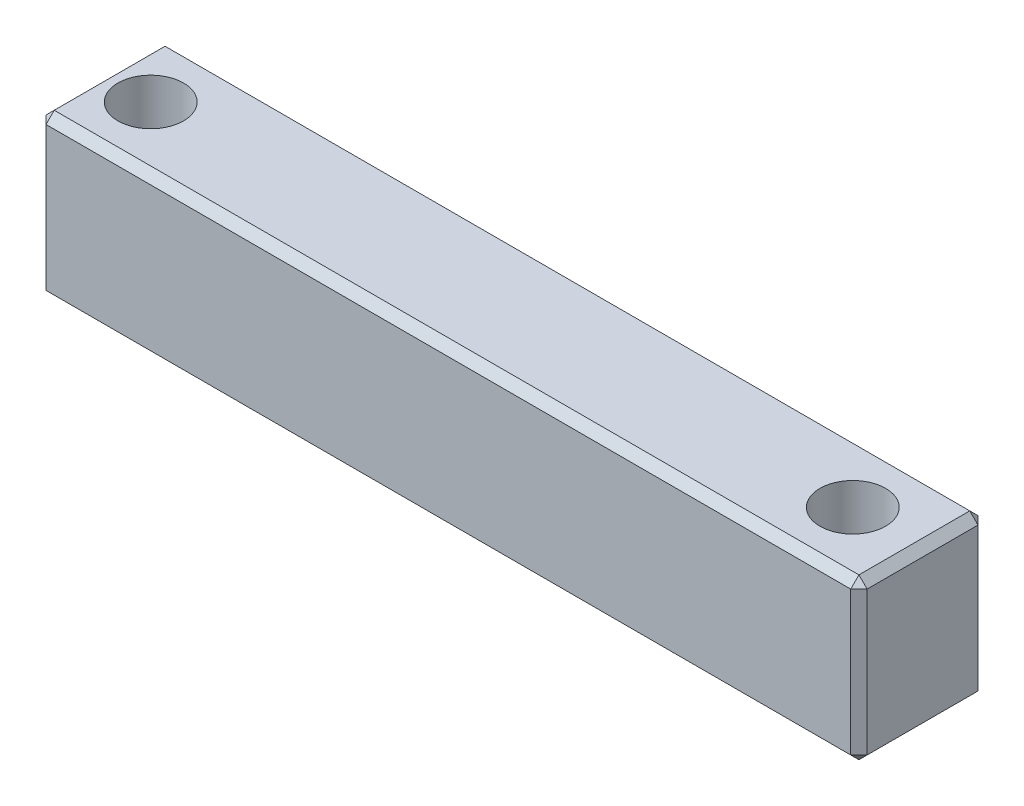
ISO-10303-21;
HEADER;
FILE_DESCRIPTION(('STEP AP214'),'2;1');
FILE_NAME('part.step','',(''),(''),'','','');
FILE_SCHEMA(('AUTOMOTIVE_DESIGN { 1 0 10303 214 1 1 1 1 }'));
ENDSEC;
DATA;
#1=APPLICATION_CONTEXT('core data for automotive mechanical design processes');
#2=APPLICATION_PROTOCOL_DEFINITION('international standard','automotive_design',2000,#1);
#3=PRODUCT_CONTEXT('',#1,'mechanical');
#4=PRODUCT('Part','Part','',(#3));
#5=PRODUCT_RELATED_PRODUCT_CATEGORY('part','',(#4));
#6=PRODUCT_DEFINITION_FORMATION('','',#4);
#7=PRODUCT_DEFINITION_CONTEXT('part definition',#1,'design');
#8=PRODUCT_DEFINITION('design','',#6,#7);
#9=PRODUCT_DEFINITION_SHAPE('','',#8);
#10=(LENGTH_UNIT() NAMED_UNIT(*) SI_UNIT(.MILLI.,.METRE.));
#11=(NAMED_UNIT(*) PLANE_ANGLE_UNIT() SI_UNIT($,.RADIAN.));
#12=(NAMED_UNIT(*) SI_UNIT($,.STERADIAN.) SOLID_ANGLE_UNIT());
#13=UNCERTAINTY_MEASURE_WITH_UNIT(LENGTH_MEASURE(1.E-05),#10,'distance_accuracy_value','');
#14=(GEOMETRIC_REPRESENTATION_CONTEXT(3) GLOBAL_UNCERTAINTY_ASSIGNED_CONTEXT((#13)) GLOBAL_UNIT_ASSIGNED_CONTEXT((#10,
#11,#12)) REPRESENTATION_CONTEXT('',''));
#15=CARTESIAN_POINT('',(0.,0.,0.));
#16=DIRECTION('',(0.,0.,1.));
#17=DIRECTION('',(1.,0.,0.));
#18=AXIS2_PLACEMENT_3D('',#15,#16,#17);
#19=CARTESIAN_POINT('',(50.,0.,0.));
#20=DIRECTION('',(0.,0.,-1.));
#21=DIRECTION('',(0.,1.,0.));
#22=AXIS2_PLACEMENT_3D('',#19,#20,#21);
#23=PLANE('',#22);
#24=DIRECTION('',(1.,0.,0.));
#25=VECTOR('',#24,1.);
#26=CARTESIAN_POINT('',(50.,0.5,0.));
#27=LINE('',#26,#25);
#28=CARTESIAN_POINT('',(0.499999999999994,0.5,0.));
#29=VERTEX_POINT('',#28);
#30=CARTESIAN_POINT('',(49.5,0.5,0.));
#31=VERTEX_POINT('',#30);
#32=EDGE_CURVE('E151',#29,#31,#27,.T.);
#33=ORIENTED_EDGE('',*,*,#32,.T.);
#34=DIRECTION('',(0.,1.,0.));
#35=VECTOR('',#34,1.);
#36=CARTESIAN_POINT('',(49.5,0.,0.));
#37=LINE('',#36,#35);
#38=CARTESIAN_POINT('',(49.5,9.25000000000001,0.));
#39=VERTEX_POINT('',#38);
#40=EDGE_CURVE('E155',#31,#39,#37,.T.);
#41=ORIENTED_EDGE('',*,*,#40,.T.);
#42=DIRECTION('',(-1.,0.,0.));
#43=VECTOR('',#42,1.);
#44=CARTESIAN_POINT('',(50.,9.25000000000001,0.));
#45=LINE('',#44,#43);
#46=CARTESIAN_POINT('',(0.499999999999994,9.25000000000001,0.));
#47=VERTEX_POINT('',#46);
#48=EDGE_CURVE('E128',#39,#47,#45,.T.);
#49=ORIENTED_EDGE('',*,*,#48,.T.);
#50=DIRECTION('',(0.,-1.,0.));
#51=VECTOR('',#50,1.);
#52=CARTESIAN_POINT('',(0.499999999999994,0.,0.));
#53=LINE('',#52,#51);
#54=EDGE_CURVE('E145',#47,#29,#53,.T.);
#55=ORIENTED_EDGE('',*,*,#54,.T.);
#56=EDGE_LOOP('',(#33,#41,#49,#55));
#57=FACE_BOUND('',#56,.T.);
#58=ADVANCED_FACE('F34',(#57),#23,.F.);
#59=CARTESIAN_POINT('',(50.,0.,0.));
#60=DIRECTION('',(0.,1.,0.));
#61=DIRECTION('',(0.,0.,1.));
#62=AXIS2_PLACEMENT_3D('',#59,#60,#61);
#63=PLANE('',#62);
#64=DIRECTION('',(0.,0.,1.));
#65=VECTOR('',#64,1.);
#66=CARTESIAN_POINT('',(49.5,0.,0.));
#67=LINE('',#66,#65);
#68=CARTESIAN_POINT('',(49.5,0.,-7.25));
#69=VERTEX_POINT('',#68);
#70=CARTESIAN_POINT('',(49.5,0.,-0.499999999999993));
#71=VERTEX_POINT('',#70);
#72=EDGE_CURVE('E172',#69,#71,#67,.T.);
#73=ORIENTED_EDGE('',*,*,#72,.T.);
#74=DIRECTION('',(-1.,0.,0.));
#75=VECTOR('',#74,1.);
#76=CARTESIAN_POINT('',(50.,0.,-0.499999999999993));
#77=LINE('',#76,#75);
#78=CARTESIAN_POINT('',(0.499999999999994,0.,-0.499999999999993));
#79=VERTEX_POINT('',#78);
#80=EDGE_CURVE('E174',#71,#79,#77,.T.);
#81=ORIENTED_EDGE('',*,*,#80,.T.);
#82=DIRECTION('',(0.,0.,-1.));
#83=VECTOR('',#82,1.);
#84=CARTESIAN_POINT('',(0.499999999999994,0.,-7.75000000000001));
#85=LINE('',#84,#83);
#86=CARTESIAN_POINT('',(0.499999999999994,0.,-7.25));
#87=VERTEX_POINT('',#86);
#88=EDGE_CURVE('E170',#79,#87,#85,.T.);
#89=ORIENTED_EDGE('',*,*,#88,.T.);
#90=DIRECTION('',(1.,0.,0.));
#91=VECTOR('',#90,1.);
#92=CARTESIAN_POINT('',(50.,0.,-7.25));
#93=LINE('',#92,#91);
#94=EDGE_CURVE('E168',#87,#69,#93,.T.);
#95=ORIENTED_EDGE('',*,*,#94,.T.);
#96=EDGE_LOOP('',(#73,#81,#89,#95));
#97=FACE_BOUND('',#96,.T.);
#98=CARTESIAN_POINT('',(3.,0.,-3.875));
#99=DIRECTION('',(0.,1.,0.));
#100=DIRECTION('',(0.,0.,1.));
#101=AXIS2_PLACEMENT_3D('',#98,#99,#100);
#102=CIRCLE('',#101,2.);
#103=CARTESIAN_POINT('',(3.,0.,-1.875));
#104=VERTEX_POINT('',#103);
#105=EDGE_CURVE('E152',#104,#104,#102,.F.);
#106=ORIENTED_EDGE('',*,*,#105,.F.);
#107=EDGE_LOOP('',(#106));
#108=FACE_BOUND('',#107,.T.);
#109=CARTESIAN_POINT('',(45.75,0.,-3.87499999999999));
#110=DIRECTION('',(0.,1.,0.));
#111=DIRECTION('',(0.,0.,1.));
#112=AXIS2_PLACEMENT_3D('',#109,#110,#111);
#113=CIRCLE('',#112,2.);
#114=CARTESIAN_POINT('',(45.75,0.,-1.875));
#115=VERTEX_POINT('',#114);
#116=EDGE_CURVE('E262',#115,#115,#113,.F.);
#117=ORIENTED_EDGE('',*,*,#116,.F.);
#118=EDGE_LOOP('',(#117));
#119=FACE_BOUND('',#118,.T.);
#120=ADVANCED_FACE('F291',(#97,#108,#119),#63,.F.);
#121=CARTESIAN_POINT('',(50.,0.,-7.75000000000001));
#122=DIRECTION('',(0.,0.,1.));
#123=DIRECTION('',(0.,-1.,0.));
#124=AXIS2_PLACEMENT_3D('',#121,#122,#123);
#125=PLANE('',#124);
#126=DIRECTION('',(0.,-1.,0.));
#127=VECTOR('',#126,1.);
#128=CARTESIAN_POINT('',(49.5,0.,-7.75000000000001));
#129=LINE('',#128,#127);
#130=CARTESIAN_POINT('',(49.5,9.25000000000001,-7.75));
#131=VERTEX_POINT('',#130);
#132=CARTESIAN_POINT('',(49.5,0.499999999999994,-7.75000000000001));
#133=VERTEX_POINT('',#132);
#134=EDGE_CURVE('E44',#131,#133,#129,.T.);
#135=ORIENTED_EDGE('',*,*,#134,.T.);
#136=DIRECTION('',(-1.,0.,0.));
#137=VECTOR('',#136,1.);
#138=CARTESIAN_POINT('',(50.,0.499999999999994,-7.75000000000001));
#139=LINE('',#138,#137);
#140=CARTESIAN_POINT('',(0.499999999999994,0.499999999999994,-7.75000000000001));
#141=VERTEX_POINT('',#140);
#142=EDGE_CURVE('E11',#133,#141,#139,.T.);
#143=ORIENTED_EDGE('',*,*,#142,.T.);
#144=DIRECTION('',(0.,1.,0.));
#145=VECTOR('',#144,1.);
#146=CARTESIAN_POINT('',(0.499999999999994,9.75,-7.75));
#147=LINE('',#146,#145);
#148=CARTESIAN_POINT('',(0.499999999999994,9.25000000000001,-7.75));
#149=VERTEX_POINT('',#148);
#150=EDGE_CURVE('E195',#141,#149,#147,.T.);
#151=ORIENTED_EDGE('',*,*,#150,.T.);
#152=DIRECTION('',(1.,0.,0.));
#153=VECTOR('',#152,1.);
#154=CARTESIAN_POINT('',(50.,9.25000000000001,-7.75));
#155=LINE('',#154,#153);
#156=EDGE_CURVE('E55',#149,#131,#155,.T.);
#157=ORIENTED_EDGE('',*,*,#156,.T.);
#158=EDGE_LOOP('',(#135,#143,#151,#157));
#159=FACE_BOUND('',#158,.T.);
#160=ADVANCED_FACE('F281',(#159),#125,.F.);
#161=CARTESIAN_POINT('',(50.,9.75,0.));
#162=DIRECTION('',(0.,-1.,0.));
#163=DIRECTION('',(0.,0.,-1.));
#164=AXIS2_PLACEMENT_3D('',#161,#162,#163);
#165=PLANE('',#164);
#166=DIRECTION('',(0.,0.,1.));
#167=VECTOR('',#166,1.);
#168=CARTESIAN_POINT('',(0.499999999999994,9.75,0.));
#169=LINE('',#168,#167);
#170=CARTESIAN_POINT('',(0.499999999999994,9.75,-7.25));
#171=VERTEX_POINT('',#170);
#172=CARTESIAN_POINT('',(0.499999999999994,9.75,-0.499999999999994));
#173=VERTEX_POINT('',#172);
#174=EDGE_CURVE('E163',#171,#173,#169,.T.);
#175=ORIENTED_EDGE('',*,*,#174,.T.);
#176=DIRECTION('',(1.,0.,0.));
#177=VECTOR('',#176,1.);
#178=CARTESIAN_POINT('',(50.,9.75,-0.499999999999994));
#179=LINE('',#178,#177);
#180=CARTESIAN_POINT('',(49.5,9.75,-0.499999999999994));
#181=VERTEX_POINT('',#180);
#182=EDGE_CURVE('E130',#173,#181,#179,.T.);
#183=ORIENTED_EDGE('',*,*,#182,.T.);
#184=DIRECTION('',(0.,0.,-1.));
#185=VECTOR('',#184,1.);
#186=CARTESIAN_POINT('',(49.5,9.75,0.));
#187=LINE('',#186,#185);
#188=CARTESIAN_POINT('',(49.5,9.75,-7.25));
#189=VERTEX_POINT('',#188);
#190=EDGE_CURVE('E165',#181,#189,#187,.T.);
#191=ORIENTED_EDGE('',*,*,#190,.T.);
#192=DIRECTION('',(-1.,0.,0.));
#193=VECTOR('',#192,1.);
#194=CARTESIAN_POINT('',(50.,9.75,-7.25));
#195=LINE('',#194,#193);
#196=EDGE_CURVE('E158',#189,#171,#195,.T.);
#197=ORIENTED_EDGE('',*,*,#196,.T.);
#198=EDGE_LOOP('',(#175,#183,#191,#197));
#199=FACE_BOUND('',#198,.T.);
#200=CARTESIAN_POINT('',(3.,9.75,-3.875));
#201=DIRECTION('',(0.,1.,0.));
#202=DIRECTION('',(0.,0.,1.));
#203=AXIS2_PLACEMENT_3D('',#200,#201,#202);
#204=CIRCLE('',#203,2.);
#205=CARTESIAN_POINT('',(3.,9.75,-1.875));
#206=VERTEX_POINT('',#205);
#207=EDGE_CURVE('E267',#206,#206,#204,.T.);
#208=ORIENTED_EDGE('',*,*,#207,.F.);
#209=EDGE_LOOP('',(#208));
#210=FACE_BOUND('',#209,.T.);
#211=CARTESIAN_POINT('',(45.75,9.75,-3.87499999999999));
#212=DIRECTION('',(0.,1.,0.));
#213=DIRECTION('',(0.,0.,1.));
#214=AXIS2_PLACEMENT_3D('',#211,#212,#213);
#215=CIRCLE('',#214,2.);
#216=CARTESIAN_POINT('',(45.75,9.75,-1.875));
#217=VERTEX_POINT('',#216);
#218=EDGE_CURVE('E256',#217,#217,#215,.T.);
#219=ORIENTED_EDGE('',*,*,#218,.F.);
#220=EDGE_LOOP('',(#219));
#221=FACE_BOUND('',#220,.T.);
#222=ADVANCED_FACE('F277',(#199,#210,#221),#165,.F.);
#223=CARTESIAN_POINT('',(50.,0.,0.));
#224=DIRECTION('',(-1.,0.,0.));
#225=DIRECTION('',(0.,0.,1.));
#226=AXIS2_PLACEMENT_3D('',#223,#224,#225);
#227=PLANE('',#226);
#228=DIRECTION('',(0.,1.,0.));
#229=VECTOR('',#228,1.);
#230=CARTESIAN_POINT('',(50.,0.,-7.25));
#231=LINE('',#230,#229);
#232=CARTESIAN_POINT('',(50.,0.499999999999994,-7.25));
#233=VERTEX_POINT('',#232);
#234=CARTESIAN_POINT('',(50.,9.25000000000001,-7.25));
#235=VERTEX_POINT('',#234);
#236=EDGE_CURVE('E177',#233,#235,#231,.T.);
#237=ORIENTED_EDGE('',*,*,#236,.T.);
#238=DIRECTION('',(0.,0.,1.));
#239=VECTOR('',#238,1.);
#240=CARTESIAN_POINT('',(50.,9.25000000000001,0.));
#241=LINE('',#240,#239);
#242=CARTESIAN_POINT('',(50.,9.25000000000001,-0.499999999999987));
#243=VERTEX_POINT('',#242);
#244=EDGE_CURVE('E183',#235,#243,#241,.T.);
#245=ORIENTED_EDGE('',*,*,#244,.T.);
#246=DIRECTION('',(0.,-1.,0.));
#247=VECTOR('',#246,1.);
#248=CARTESIAN_POINT('',(50.,0.,-0.499999999999994));
#249=LINE('',#248,#247);
#250=CARTESIAN_POINT('',(50.,0.499999999999994,-0.499999999999993));
#251=VERTEX_POINT('',#250);
#252=EDGE_CURVE('E181',#243,#251,#249,.T.);
#253=ORIENTED_EDGE('',*,*,#252,.T.);
#254=DIRECTION('',(0.,0.,-1.));
#255=VECTOR('',#254,1.);
#256=CARTESIAN_POINT('',(50.,0.499999999999994,0.));
#257=LINE('',#256,#255);
#258=EDGE_CURVE('E179',#251,#233,#257,.T.);
#259=ORIENTED_EDGE('',*,*,#258,.T.);
#260=EDGE_LOOP('',(#237,#245,#253,#259));
#261=FACE_BOUND('',#260,.T.);
#262=ADVANCED_FACE('F280',(#261),#227,.F.);
#263=CARTESIAN_POINT('',(0.,0.,0.));
#264=DIRECTION('',(-1.,0.,0.));
#265=DIRECTION('',(0.,0.,1.));
#266=AXIS2_PLACEMENT_3D('',#263,#264,#265);
#267=PLANE('',#266);
#268=DIRECTION('',(0.,-1.,0.));
#269=VECTOR('',#268,1.);
#270=CARTESIAN_POINT('',(0.,0.,-7.25));
#271=LINE('',#270,#269);
#272=CARTESIAN_POINT('',(0.,9.25,-7.25));
#273=VERTEX_POINT('',#272);
#274=CARTESIAN_POINT('',(0.,0.5,-7.25));
#275=VERTEX_POINT('',#274);
#276=EDGE_CURVE('E186',#273,#275,#271,.T.);
#277=ORIENTED_EDGE('',*,*,#276,.T.);
#278=DIRECTION('',(0.,0.,1.));
#279=VECTOR('',#278,1.);
#280=CARTESIAN_POINT('',(0.,0.5,0.));
#281=LINE('',#280,#279);
#282=CARTESIAN_POINT('',(0.,0.5,-0.5));
#283=VERTEX_POINT('',#282);
#284=EDGE_CURVE('E192',#275,#283,#281,.T.);
#285=ORIENTED_EDGE('',*,*,#284,.T.);
#286=DIRECTION('',(0.,1.,0.));
#287=VECTOR('',#286,1.);
#288=CARTESIAN_POINT('',(0.,9.75,-0.499999999999993));
#289=LINE('',#288,#287);
#290=CARTESIAN_POINT('',(0.,9.25,-0.499999999999994));
#291=VERTEX_POINT('',#290);
#292=EDGE_CURVE('E190',#283,#291,#289,.T.);
#293=ORIENTED_EDGE('',*,*,#292,.T.);
#294=DIRECTION('',(0.,0.,-1.));
#295=VECTOR('',#294,1.);
#296=CARTESIAN_POINT('',(0.,9.25,-7.75));
#297=LINE('',#296,#295);
#298=EDGE_CURVE('E188',#291,#273,#297,.T.);
#299=ORIENTED_EDGE('',*,*,#298,.T.);
#300=EDGE_LOOP('',(#277,#285,#293,#299));
#301=FACE_BOUND('',#300,.T.);
#302=ADVANCED_FACE('F288',(#301),#267,.T.);
#303=CARTESIAN_POINT('',(45.75,-5.65685424949238,-3.87499999999999));
#304=DIRECTION('',(0.,1.,0.));
#305=DIRECTION('',(0.,0.,1.));
#306=AXIS2_PLACEMENT_3D('',#303,#304,#305);
#307=CYLINDRICAL_SURFACE('',#306,2.);
#308=ORIENTED_EDGE('',*,*,#116,.T.);
#309=EDGE_LOOP('',(#308));
#310=FACE_BOUND('',#309,.T.);
#311=ORIENTED_EDGE('',*,*,#218,.T.);
#312=EDGE_LOOP('',(#311));
#313=FACE_BOUND('',#312,.T.);
#314=ADVANCED_FACE('F459',(#310,#313),#307,.F.);
#315=CARTESIAN_POINT('',(3.,-5.65685424949238,-3.875));
#316=DIRECTION('',(0.,1.,0.));
#317=DIRECTION('',(0.,0.,1.));
#318=AXIS2_PLACEMENT_3D('',#315,#316,#317);
#319=CYLINDRICAL_SURFACE('',#318,2.);
#320=ORIENTED_EDGE('',*,*,#105,.T.);
#321=EDGE_LOOP('',(#320));
#322=FACE_BOUND('',#321,.T.);
#323=ORIENTED_EDGE('',*,*,#207,.T.);
#324=EDGE_LOOP('',(#323));
#325=FACE_BOUND('',#324,.T.);
#326=ADVANCED_FACE('F275',(#322,#325),#319,.F.);
#327=CARTESIAN_POINT('',(50.,0.499999999999994,-7.75000000000001));
#328=DIRECTION('',(0.,0.707106781186552,0.707106781186543));
#329=DIRECTION('',(-1.,0.,0.));
#330=AXIS2_PLACEMENT_3D('',#327,#328,#329);
#331=PLANE('',#330);
#332=DIRECTION('',(0.,-0.707106781186543,0.707106781186552));
#333=VECTOR('',#332,1.);
#334=CARTESIAN_POINT('',(49.5,0.249999999999997,-7.50000000000001));
#335=LINE('',#334,#333);
#336=EDGE_CURVE('E39',#69,#133,#335,.F.);
#337=ORIENTED_EDGE('',*,*,#336,.F.);
#338=ORIENTED_EDGE('',*,*,#94,.F.);
#339=DIRECTION('',(0.,0.707106781186543,-0.707106781186552));
#340=VECTOR('',#339,1.);
#341=CARTESIAN_POINT('',(0.499999999999994,0.,-7.25));
#342=LINE('',#341,#340);
#343=EDGE_CURVE('E249',#141,#87,#342,.F.);
#344=ORIENTED_EDGE('',*,*,#343,.F.);
#345=ORIENTED_EDGE('',*,*,#142,.F.);
#346=EDGE_LOOP('',(#337,#338,#344,#345));
#347=FACE_BOUND('',#346,.T.);
#348=ADVANCED_FACE('F37',(#347),#331,.F.);
#349=CARTESIAN_POINT('',(50.,0.499999999999994,-7.25));
#350=DIRECTION('',(0.577350269189626,-0.577350269189634,-0.577350269189618));
#351=DIRECTION('',(0.707106781186552,0.707106781186543,0.));
#352=AXIS2_PLACEMENT_3D('',#349,#350,#351);
#353=PLANE('',#352);
#354=DIRECTION('',(0.707106781186552,0.707106781186543,0.));
#355=VECTOR('',#354,1.);
#356=CARTESIAN_POINT('',(50.,0.499999999999994,-7.25));
#357=LINE('',#356,#355);
#358=EDGE_CURVE('E244',#69,#233,#357,.T.);
#359=ORIENTED_EDGE('',*,*,#358,.F.);
#360=ORIENTED_EDGE('',*,*,#336,.T.);
#361=DIRECTION('',(-0.707106781186543,0.,-0.707106781186552));
#362=VECTOR('',#361,1.);
#363=CARTESIAN_POINT('',(50.,0.499999999999994,-7.25));
#364=LINE('',#363,#362);
#365=EDGE_CURVE('E247',#233,#133,#364,.T.);
#366=ORIENTED_EDGE('',*,*,#365,.F.);
#367=EDGE_LOOP('',(#359,#360,#366));
#368=FACE_BOUND('',#367,.T.);
#369=ADVANCED_FACE('F421',(#368),#353,.T.);
#370=CARTESIAN_POINT('',(0.499999999999994,0.,-7.25));
#371=DIRECTION('',(-0.577350269189634,-0.577350269189626,-0.577350269189618));
#372=DIRECTION('',(0.707106781186543,-0.707106781186552,0.));
#373=AXIS2_PLACEMENT_3D('',#370,#371,#372);
#374=PLANE('',#373);
#375=DIRECTION('',(0.707106781186543,0.,-0.707106781186552));
#376=VECTOR('',#375,1.);
#377=CARTESIAN_POINT('',(0.249999999999997,0.499999999999997,-7.50000000000001));
#378=LINE('',#377,#376);
#379=EDGE_CURVE('E238',#141,#275,#378,.F.);
#380=ORIENTED_EDGE('',*,*,#379,.F.);
#381=ORIENTED_EDGE('',*,*,#343,.T.);
#382=DIRECTION('',(-0.707106781186543,0.707106781186552,0.));
#383=VECTOR('',#382,1.);
#384=CARTESIAN_POINT('',(0.499999999999994,0.,-7.25));
#385=LINE('',#384,#383);
#386=EDGE_CURVE('E241',#275,#87,#385,.F.);
#387=ORIENTED_EDGE('',*,*,#386,.F.);
#388=EDGE_LOOP('',(#380,#381,#387));
#389=FACE_BOUND('',#388,.T.);
#390=ADVANCED_FACE('F415',(#389),#374,.T.);
#391=CARTESIAN_POINT('',(50.,0.,-7.25));
#392=DIRECTION('',(-0.707106781186552,0.,0.707106781186543));
#393=DIRECTION('',(0.,1.,0.));
#394=AXIS2_PLACEMENT_3D('',#391,#392,#393);
#395=PLANE('',#394);
#396=ORIENTED_EDGE('',*,*,#365,.T.);
#397=ORIENTED_EDGE('',*,*,#134,.F.);
#398=DIRECTION('',(0.707106781186543,0.,0.707106781186552));
#399=VECTOR('',#398,1.);
#400=CARTESIAN_POINT('',(49.75,9.25000000000001,-7.5));
#401=LINE('',#400,#399);
#402=EDGE_CURVE('E232',#235,#131,#401,.F.);
#403=ORIENTED_EDGE('',*,*,#402,.F.);
#404=ORIENTED_EDGE('',*,*,#236,.F.);
#405=EDGE_LOOP('',(#396,#397,#403,#404));
#406=FACE_BOUND('',#405,.T.);
#407=ADVANCED_FACE('F408',(#406),#395,.F.);
#408=CARTESIAN_POINT('',(50.,0.499999999999994,0.));
#409=DIRECTION('',(-0.707106781186543,0.707106781186552,0.));
#410=DIRECTION('',(0.,0.,-1.));
#411=AXIS2_PLACEMENT_3D('',#408,#409,#410);
#412=PLANE('',#411);
#413=ORIENTED_EDGE('',*,*,#358,.T.);
#414=ORIENTED_EDGE('',*,*,#258,.F.);
#415=DIRECTION('',(-0.707106781186552,-0.707106781186543,0.));
#416=VECTOR('',#415,1.);
#417=CARTESIAN_POINT('',(49.75,0.249999999999997,-0.499999999999993));
#418=LINE('',#417,#416);
#419=EDGE_CURVE('E229',#71,#251,#418,.F.);
#420=ORIENTED_EDGE('',*,*,#419,.F.);
#421=ORIENTED_EDGE('',*,*,#72,.F.);
#422=EDGE_LOOP('',(#413,#414,#420,#421));
#423=FACE_BOUND('',#422,.T.);
#424=ADVANCED_FACE('F401',(#423),#412,.F.);
#425=CARTESIAN_POINT('',(50.,0.,-0.499999999999993));
#426=DIRECTION('',(0.,0.707106781186543,-0.707106781186552));
#427=DIRECTION('',(-1.,0.,0.));
#428=AXIS2_PLACEMENT_3D('',#425,#426,#427);
#429=PLANE('',#428);
#430=DIRECTION('',(0.,-0.707106781186552,-0.707106781186543));
#431=VECTOR('',#430,1.);
#432=CARTESIAN_POINT('',(0.499999999999994,0.,-0.499999999999993));
#433=LINE('',#432,#431);
#434=EDGE_CURVE('E223',#79,#29,#433,.F.);
#435=ORIENTED_EDGE('',*,*,#434,.F.);
#436=ORIENTED_EDGE('',*,*,#80,.F.);
#437=DIRECTION('',(0.,0.707106781186552,0.707106781186543));
#438=VECTOR('',#437,1.);
#439=CARTESIAN_POINT('',(49.5,0.5,0.));
#440=LINE('',#439,#438);
#441=EDGE_CURVE('E226',#31,#71,#440,.F.);
#442=ORIENTED_EDGE('',*,*,#441,.F.);
#443=ORIENTED_EDGE('',*,*,#32,.F.);
#444=EDGE_LOOP('',(#435,#436,#442,#443));
#445=FACE_BOUND('',#444,.T.);
#446=ADVANCED_FACE('F394',(#445),#429,.F.);
#447=CARTESIAN_POINT('',(0.499999999999994,0.,0.));
#448=DIRECTION('',(-0.707106781186552,-0.707106781186543,0.));
#449=DIRECTION('',(0.,0.,1.));
#450=AXIS2_PLACEMENT_3D('',#447,#448,#449);
#451=PLANE('',#450);
#452=ORIENTED_EDGE('',*,*,#386,.T.);
#453=ORIENTED_EDGE('',*,*,#88,.F.);
#454=DIRECTION('',(0.707106781186543,-0.707106781186552,0.));
#455=VECTOR('',#454,1.);
#456=CARTESIAN_POINT('',(0.499999999999994,0.,-0.499999999999993));
#457=LINE('',#456,#455);
#458=EDGE_CURVE('E221',#283,#79,#457,.T.);
#459=ORIENTED_EDGE('',*,*,#458,.F.);
#460=ORIENTED_EDGE('',*,*,#284,.F.);
#461=EDGE_LOOP('',(#452,#453,#459,#460));
#462=FACE_BOUND('',#461,.T.);
#463=ADVANCED_FACE('F387',(#462),#451,.T.);
#464=CARTESIAN_POINT('',(0.499999999999994,0.,-7.75000000000001));
#465=DIRECTION('',(-0.707106781186552,0.,-0.707106781186543));
#466=DIRECTION('',(0.,-1.,0.));
#467=AXIS2_PLACEMENT_3D('',#464,#465,#466);
#468=PLANE('',#467);
#469=ORIENTED_EDGE('',*,*,#379,.T.);
#470=ORIENTED_EDGE('',*,*,#276,.F.);
#471=DIRECTION('',(-0.707106781186543,0.,0.707106781186552));
#472=VECTOR('',#471,1.);
#473=CARTESIAN_POINT('',(0.,9.25,-7.25));
#474=LINE('',#473,#472);
#475=EDGE_CURVE('E218',#149,#273,#474,.T.);
#476=ORIENTED_EDGE('',*,*,#475,.F.);
#477=ORIENTED_EDGE('',*,*,#150,.F.);
#478=EDGE_LOOP('',(#469,#470,#476,#477));
#479=FACE_BOUND('',#478,.T.);
#480=ADVANCED_FACE('F380',(#479),#468,.T.);
#481=CARTESIAN_POINT('',(50.,9.75,-7.25));
#482=DIRECTION('',(0.,-0.707106781186552,0.707106781186543));
#483=DIRECTION('',(-1.,0.,0.));
#484=AXIS2_PLACEMENT_3D('',#481,#482,#483);
#485=PLANE('',#484);
#486=DIRECTION('',(0.,-0.707106781186543,-0.707106781186552));
#487=VECTOR('',#486,1.);
#488=CARTESIAN_POINT('',(49.5,9.75,-7.25));
#489=LINE('',#488,#487);
#490=EDGE_CURVE('E235',#131,#189,#489,.F.);
#491=ORIENTED_EDGE('',*,*,#490,.F.);
#492=ORIENTED_EDGE('',*,*,#156,.F.);
#493=DIRECTION('',(0.,0.707106781186543,0.707106781186552));
#494=VECTOR('',#493,1.);
#495=CARTESIAN_POINT('',(0.499999999999993,9.5,-7.5));
#496=LINE('',#495,#494);
#497=EDGE_CURVE('E215',#171,#149,#496,.F.);
#498=ORIENTED_EDGE('',*,*,#497,.F.);
#499=ORIENTED_EDGE('',*,*,#196,.F.);
#500=EDGE_LOOP('',(#491,#492,#498,#499));
#501=FACE_BOUND('',#500,.T.);
#502=ADVANCED_FACE('F373',(#501),#485,.F.);
#503=CARTESIAN_POINT('',(49.5,9.75,-7.25));
#504=DIRECTION('',(0.577350269189626,0.577350269189634,-0.577350269189618));
#505=DIRECTION('',(-0.707106781186552,0.707106781186543,0.));
#506=AXIS2_PLACEMENT_3D('',#503,#504,#505);
#507=PLANE('',#506);
#508=ORIENTED_EDGE('',*,*,#402,.T.);
#509=ORIENTED_EDGE('',*,*,#490,.T.);
#510=DIRECTION('',(-0.707106781186552,0.707106781186543,0.));
#511=VECTOR('',#510,1.);
#512=CARTESIAN_POINT('',(49.5,9.75,-7.25));
#513=LINE('',#512,#511);
#514=EDGE_CURVE('E212',#235,#189,#513,.T.);
#515=ORIENTED_EDGE('',*,*,#514,.F.);
#516=EDGE_LOOP('',(#508,#509,#515));
#517=FACE_BOUND('',#516,.T.);
#518=ADVANCED_FACE('F366',(#517),#507,.T.);
#519=CARTESIAN_POINT('',(49.5,0.5,0.));
#520=DIRECTION('',(0.577350269189618,-0.577350269189626,0.577350269189634));
#521=DIRECTION('',(0.,-0.707106781186552,-0.707106781186543));
#522=AXIS2_PLACEMENT_3D('',#519,#520,#521);
#523=PLANE('',#522);
#524=ORIENTED_EDGE('',*,*,#441,.T.);
#525=ORIENTED_EDGE('',*,*,#419,.T.);
#526=DIRECTION('',(0.707106781186552,0.,-0.707106781186543));
#527=VECTOR('',#526,1.);
#528=CARTESIAN_POINT('',(49.5,0.5,0.));
#529=LINE('',#528,#527);
#530=EDGE_CURVE('E209',#31,#251,#529,.T.);
#531=ORIENTED_EDGE('',*,*,#530,.F.);
#532=EDGE_LOOP('',(#524,#525,#531));
#533=FACE_BOUND('',#532,.T.);
#534=ADVANCED_FACE('F359',(#533),#523,.T.);
#535=CARTESIAN_POINT('',(0.499999999999994,0.,-0.499999999999993));
#536=DIRECTION('',(-0.577350269189634,-0.577350269189618,0.577350269189626));
#537=DIRECTION('',(0.707106781186543,0.,0.707106781186553));
#538=AXIS2_PLACEMENT_3D('',#535,#536,#537);
#539=PLANE('',#538);
#540=ORIENTED_EDGE('',*,*,#458,.T.);
#541=ORIENTED_EDGE('',*,*,#434,.T.);
#542=DIRECTION('',(-0.707106781186543,0.,-0.707106781186552));
#543=VECTOR('',#542,1.);
#544=CARTESIAN_POINT('',(0.249999999999997,0.5,-0.25));
#545=LINE('',#544,#543);
#546=EDGE_CURVE('E148',#283,#29,#545,.F.);
#547=ORIENTED_EDGE('',*,*,#546,.F.);
#548=EDGE_LOOP('',(#540,#541,#547));
#549=FACE_BOUND('',#548,.T.);
#550=ADVANCED_FACE('F352',(#549),#539,.T.);
#551=CARTESIAN_POINT('',(0.,9.25,-7.25));
#552=DIRECTION('',(-0.577350269189634,0.577350269189626,-0.577350269189618));
#553=DIRECTION('',(-0.707106781186543,-0.707106781186552,0.));
#554=AXIS2_PLACEMENT_3D('',#551,#552,#553);
#555=PLANE('',#554);
#556=ORIENTED_EDGE('',*,*,#497,.T.);
#557=ORIENTED_EDGE('',*,*,#475,.T.);
#558=DIRECTION('',(0.707106781186543,0.707106781186552,0.));
#559=VECTOR('',#558,1.);
#560=CARTESIAN_POINT('',(0.,9.25,-7.25));
#561=LINE('',#560,#559);
#562=EDGE_CURVE('E205',#171,#273,#561,.F.);
#563=ORIENTED_EDGE('',*,*,#562,.F.);
#564=EDGE_LOOP('',(#556,#557,#563));
#565=FACE_BOUND('',#564,.T.);
#566=ADVANCED_FACE('F345',(#565),#555,.T.);
#567=CARTESIAN_POINT('',(50.,9.25000000000001,0.));
#568=DIRECTION('',(-0.707106781186543,-0.707106781186552,0.));
#569=DIRECTION('',(0.,0.,1.));
#570=AXIS2_PLACEMENT_3D('',#567,#568,#569);
#571=PLANE('',#570);
#572=ORIENTED_EDGE('',*,*,#514,.T.);
#573=ORIENTED_EDGE('',*,*,#190,.F.);
#574=DIRECTION('',(0.707106781186552,-0.707106781186543,0.));
#575=VECTOR('',#574,1.);
#576=CARTESIAN_POINT('',(49.5,9.75,-0.499999999999994));
#577=LINE('',#576,#575);
#578=EDGE_CURVE('E202',#243,#181,#577,.F.);
#579=ORIENTED_EDGE('',*,*,#578,.F.);
#580=ORIENTED_EDGE('',*,*,#244,.F.);
#581=EDGE_LOOP('',(#572,#573,#579,#580));
#582=FACE_BOUND('',#581,.T.);
#583=ADVANCED_FACE('F338',(#582),#571,.F.);
#584=CARTESIAN_POINT('',(50.,0.,-0.499999999999994));
#585=DIRECTION('',(-0.707106781186543,0.,-0.707106781186552));
#586=DIRECTION('',(0.,-1.,0.));
#587=AXIS2_PLACEMENT_3D('',#584,#585,#586);
#588=PLANE('',#587);
#589=ORIENTED_EDGE('',*,*,#530,.T.);
#590=ORIENTED_EDGE('',*,*,#252,.F.);
#591=DIRECTION('',(-0.707106781186552,0.,0.707106781186543));
#592=VECTOR('',#591,1.);
#593=CARTESIAN_POINT('',(49.75,9.25000000000001,-0.24999999999999));
#594=LINE('',#593,#592);
#595=EDGE_CURVE('E142',#39,#243,#594,.F.);
#596=ORIENTED_EDGE('',*,*,#595,.F.);
#597=ORIENTED_EDGE('',*,*,#40,.F.);
#598=EDGE_LOOP('',(#589,#590,#596,#597));
#599=FACE_BOUND('',#598,.T.);
#600=ADVANCED_FACE('F332',(#599),#588,.F.);
#601=CARTESIAN_POINT('',(0.499999999999994,0.,0.));
#602=DIRECTION('',(-0.707106781186552,0.,0.707106781186543));
#603=DIRECTION('',(0.,1.,0.));
#604=AXIS2_PLACEMENT_3D('',#601,#602,#603);
#605=PLANE('',#604);
#606=ORIENTED_EDGE('',*,*,#546,.T.);
#607=ORIENTED_EDGE('',*,*,#54,.F.);
#608=DIRECTION('',(0.707106781186543,0.,0.707106781186552));
#609=VECTOR('',#608,1.);
#610=CARTESIAN_POINT('',(0.499999999999994,9.25000000000001,0.));
#611=LINE('',#610,#609);
#612=EDGE_CURVE('E136',#291,#47,#611,.T.);
#613=ORIENTED_EDGE('',*,*,#612,.F.);
#614=ORIENTED_EDGE('',*,*,#292,.F.);
#615=EDGE_LOOP('',(#606,#607,#613,#614));
#616=FACE_BOUND('',#615,.T.);
#617=ADVANCED_FACE('F146',(#616),#605,.T.);
#618=CARTESIAN_POINT('',(0.499999999999994,9.75,0.));
#619=DIRECTION('',(-0.707106781186552,0.707106781186543,0.));
#620=DIRECTION('',(0.,0.,-1.));
#621=AXIS2_PLACEMENT_3D('',#618,#619,#620);
#622=PLANE('',#621);
#623=ORIENTED_EDGE('',*,*,#562,.T.);
#624=ORIENTED_EDGE('',*,*,#298,.F.);
#625=DIRECTION('',(-0.707106781186543,-0.707106781186552,0.));
#626=VECTOR('',#625,1.);
#627=CARTESIAN_POINT('',(0.249999999999997,9.5,-0.499999999999994));
#628=LINE('',#627,#626);
#629=EDGE_CURVE('E140',#173,#291,#628,.T.);
#630=ORIENTED_EDGE('',*,*,#629,.F.);
#631=ORIENTED_EDGE('',*,*,#174,.F.);
#632=EDGE_LOOP('',(#623,#624,#630,#631));
#633=FACE_BOUND('',#632,.T.);
#634=ADVANCED_FACE('F319',(#633),#622,.T.);
#635=CARTESIAN_POINT('',(49.5,9.75,-0.499999999999994));
#636=DIRECTION('',(0.577350269189618,0.577350269189634,0.577350269189626));
#637=DIRECTION('',(0.,-0.707106781186543,0.707106781186552));
#638=AXIS2_PLACEMENT_3D('',#635,#636,#637);
#639=PLANE('',#638);
#640=ORIENTED_EDGE('',*,*,#595,.T.);
#641=ORIENTED_EDGE('',*,*,#578,.T.);
#642=DIRECTION('',(0.,0.707106781186543,-0.707106781186552));
#643=VECTOR('',#642,1.);
#644=CARTESIAN_POINT('',(49.5,9.75,-0.499999999999994));
#645=LINE('',#644,#643);
#646=EDGE_CURVE('E133',#39,#181,#645,.T.);
#647=ORIENTED_EDGE('',*,*,#646,.F.);
#648=EDGE_LOOP('',(#640,#641,#647));
#649=FACE_BOUND('',#648,.T.);
#650=ADVANCED_FACE('F313',(#649),#639,.T.);
#651=CARTESIAN_POINT('',(0.499999999999994,9.25000000000001,0.));
#652=DIRECTION('',(-0.577350269189634,0.577350269189626,0.577350269189618));
#653=DIRECTION('',(-0.707106781186543,-0.707106781186552,0.));
#654=AXIS2_PLACEMENT_3D('',#651,#652,#653);
#655=PLANE('',#654);
#656=ORIENTED_EDGE('',*,*,#629,.T.);
#657=ORIENTED_EDGE('',*,*,#612,.T.);
#658=DIRECTION('',(0.,-0.707106781186543,0.707106781186552));
#659=VECTOR('',#658,1.);
#660=CARTESIAN_POINT('',(0.499999999999994,9.25000000000001,0.));
#661=LINE('',#660,#659);
#662=EDGE_CURVE('E124',#173,#47,#661,.T.);
#663=ORIENTED_EDGE('',*,*,#662,.F.);
#664=EDGE_LOOP('',(#656,#657,#663));
#665=FACE_BOUND('',#664,.T.);
#666=ADVANCED_FACE('F138',(#665),#655,.T.);
#667=CARTESIAN_POINT('',(50.,9.25000000000001,0.));
#668=DIRECTION('',(0.,-0.707106781186552,-0.707106781186543));
#669=DIRECTION('',(-1.,0.,0.));
#670=AXIS2_PLACEMENT_3D('',#667,#668,#669);
#671=PLANE('',#670);
#672=ORIENTED_EDGE('',*,*,#646,.T.);
#673=ORIENTED_EDGE('',*,*,#182,.F.);
#674=ORIENTED_EDGE('',*,*,#662,.T.);
#675=ORIENTED_EDGE('',*,*,#48,.F.);
#676=EDGE_LOOP('',(#672,#673,#674,#675));
#677=FACE_BOUND('',#676,.T.);
#678=ADVANCED_FACE('F126',(#677),#671,.F.);
#679=CLOSED_SHELL('',(#58,#120,#160,#222,#262,#302,#314,#326,#348,#369,#390,#407,#424,#446,#463,
#480,#502,#518,#534,#550,#566,#583,#600,#617,#634,#650,#666,#678));
#680=MANIFOLD_SOLID_BREP('B2',#679);
#681=ADVANCED_BREP_SHAPE_REPRESENTATION('',(#18,#680),#14);
#682=SHAPE_DEFINITION_REPRESENTATION(#9,#681);
ENDSEC;
END-ISO-10303-21;
